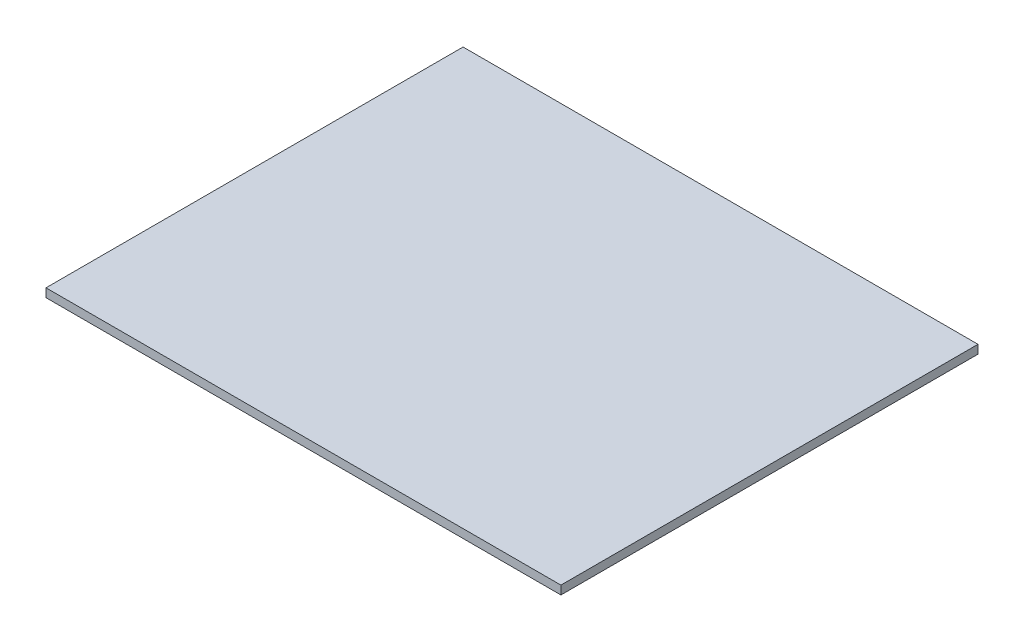
ISO-10303-21;
HEADER;
FILE_DESCRIPTION(('STEP AP214'),'2;1');
FILE_NAME('part.step','',(''),(''),'','','');
FILE_SCHEMA(('AUTOMOTIVE_DESIGN { 1 0 10303 214 1 1 1 1 }'));
ENDSEC;
DATA;
#1=APPLICATION_CONTEXT('core data for automotive mechanical design processes');
#2=APPLICATION_PROTOCOL_DEFINITION('international standard','automotive_design',2000,#1);
#3=PRODUCT_CONTEXT('',#1,'mechanical');
#4=PRODUCT('Part','Part','',(#3));
#5=PRODUCT_RELATED_PRODUCT_CATEGORY('part','',(#4));
#6=PRODUCT_DEFINITION_FORMATION('','',#4);
#7=PRODUCT_DEFINITION_CONTEXT('part definition',#1,'design');
#8=PRODUCT_DEFINITION('design','',#6,#7);
#9=PRODUCT_DEFINITION_SHAPE('','',#8);
#10=(LENGTH_UNIT() NAMED_UNIT(*) SI_UNIT(.MILLI.,.METRE.));
#11=(NAMED_UNIT(*) PLANE_ANGLE_UNIT() SI_UNIT($,.RADIAN.));
#12=(NAMED_UNIT(*) SI_UNIT($,.STERADIAN.) SOLID_ANGLE_UNIT());
#13=UNCERTAINTY_MEASURE_WITH_UNIT(LENGTH_MEASURE(1.E-05),#10,'distance_accuracy_value','');
#14=(GEOMETRIC_REPRESENTATION_CONTEXT(3) GLOBAL_UNCERTAINTY_ASSIGNED_CONTEXT((#13)) GLOBAL_UNIT_ASSIGNED_CONTEXT((#10,
#11,#12)) REPRESENTATION_CONTEXT('',''));
#15=CARTESIAN_POINT('',(0.,0.,0.));
#16=DIRECTION('',(0.,0.,1.));
#17=DIRECTION('',(1.,0.,0.));
#18=AXIS2_PLACEMENT_3D('',#15,#16,#17);
#19=CARTESIAN_POINT('',(0.,10.,0.));
#20=DIRECTION('',(1.,0.,0.));
#21=DIRECTION('',(0.,0.,-1.));
#22=AXIS2_PLACEMENT_3D('',#19,#20,#21);
#23=PLANE('',#22);
#24=DIRECTION('',(0.,0.,1.));
#25=VECTOR('',#24,1.);
#26=CARTESIAN_POINT('',(0.,0.,0.));
#27=LINE('',#26,#25);
#28=CARTESIAN_POINT('',(0.,0.,-486.));
#29=VERTEX_POINT('',#28);
#30=CARTESIAN_POINT('',(0.,0.,0.));
#31=VERTEX_POINT('',#30);
#32=EDGE_CURVE('E107',#29,#31,#27,.T.);
#33=ORIENTED_EDGE('',*,*,#32,.T.);
#34=DIRECTION('',(0.,-1.,0.));
#35=VECTOR('',#34,1.);
#36=CARTESIAN_POINT('',(0.,10.,0.));
#37=LINE('',#36,#35);
#38=CARTESIAN_POINT('',(0.,10.,0.));
#39=VERTEX_POINT('',#38);
#40=EDGE_CURVE('E11',#39,#31,#37,.T.);
#41=ORIENTED_EDGE('',*,*,#40,.F.);
#42=DIRECTION('',(0.,0.,1.));
#43=VECTOR('',#42,1.);
#44=CARTESIAN_POINT('',(0.,10.,0.));
#45=LINE('',#44,#43);
#46=CARTESIAN_POINT('',(0.,10.,-486.));
#47=VERTEX_POINT('',#46);
#48=EDGE_CURVE('E91',#47,#39,#45,.T.);
#49=ORIENTED_EDGE('',*,*,#48,.F.);
#50=DIRECTION('',(0.,-1.,0.));
#51=VECTOR('',#50,1.);
#52=CARTESIAN_POINT('',(0.,10.,-486.));
#53=LINE('',#52,#51);
#54=EDGE_CURVE('E103',#47,#29,#53,.T.);
#55=ORIENTED_EDGE('',*,*,#54,.T.);
#56=EDGE_LOOP('',(#33,#41,#49,#55));
#57=FACE_BOUND('',#56,.T.);
#58=ADVANCED_FACE('F39',(#57),#23,.F.);
#59=CARTESIAN_POINT('',(0.,10.,0.));
#60=DIRECTION('',(0.,0.,-1.));
#61=DIRECTION('',(-1.,0.,0.));
#62=AXIS2_PLACEMENT_3D('',#59,#60,#61);
#63=PLANE('',#62);
#64=DIRECTION('',(1.,0.,0.));
#65=VECTOR('',#64,1.);
#66=CARTESIAN_POINT('',(0.,0.,0.));
#67=LINE('',#66,#65);
#68=CARTESIAN_POINT('',(600.,0.,0.));
#69=VERTEX_POINT('',#68);
#70=EDGE_CURVE('E96',#31,#69,#67,.T.);
#71=ORIENTED_EDGE('',*,*,#70,.T.);
#72=DIRECTION('',(0.,-1.,0.));
#73=VECTOR('',#72,1.);
#74=CARTESIAN_POINT('',(600.,10.,0.));
#75=LINE('',#74,#73);
#76=CARTESIAN_POINT('',(600.,10.,0.));
#77=VERTEX_POINT('',#76);
#78=EDGE_CURVE('E48',#77,#69,#75,.T.);
#79=ORIENTED_EDGE('',*,*,#78,.F.);
#80=DIRECTION('',(1.,0.,0.));
#81=VECTOR('',#80,1.);
#82=CARTESIAN_POINT('',(0.,10.,0.));
#83=LINE('',#82,#81);
#84=EDGE_CURVE('E86',#39,#77,#83,.T.);
#85=ORIENTED_EDGE('',*,*,#84,.F.);
#86=ORIENTED_EDGE('',*,*,#40,.T.);
#87=EDGE_LOOP('',(#71,#79,#85,#86));
#88=FACE_BOUND('',#87,.T.);
#89=ADVANCED_FACE('F95',(#88),#63,.F.);
#90=CARTESIAN_POINT('',(600.,10.,0.));
#91=DIRECTION('',(-1.,0.,0.));
#92=DIRECTION('',(0.,0.,1.));
#93=AXIS2_PLACEMENT_3D('',#90,#91,#92);
#94=PLANE('',#93);
#95=DIRECTION('',(0.,0.,-1.));
#96=VECTOR('',#95,1.);
#97=CARTESIAN_POINT('',(600.,0.,0.));
#98=LINE('',#97,#96);
#99=CARTESIAN_POINT('',(600.,0.,-486.));
#100=VERTEX_POINT('',#99);
#101=EDGE_CURVE('E73',#69,#100,#98,.T.);
#102=ORIENTED_EDGE('',*,*,#101,.T.);
#103=DIRECTION('',(0.,-1.,0.));
#104=VECTOR('',#103,1.);
#105=CARTESIAN_POINT('',(600.,10.,-486.));
#106=LINE('',#105,#104);
#107=CARTESIAN_POINT('',(600.,10.,-486.));
#108=VERTEX_POINT('',#107);
#109=EDGE_CURVE('E98',#108,#100,#106,.T.);
#110=ORIENTED_EDGE('',*,*,#109,.F.);
#111=DIRECTION('',(0.,0.,-1.));
#112=VECTOR('',#111,1.);
#113=CARTESIAN_POINT('',(600.,10.,0.));
#114=LINE('',#113,#112);
#115=EDGE_CURVE('E89',#77,#108,#114,.T.);
#116=ORIENTED_EDGE('',*,*,#115,.F.);
#117=ORIENTED_EDGE('',*,*,#78,.T.);
#118=EDGE_LOOP('',(#102,#110,#116,#117));
#119=FACE_BOUND('',#118,.T.);
#120=ADVANCED_FACE('F99',(#119),#94,.F.);
#121=CARTESIAN_POINT('',(0.,10.,-486.));
#122=DIRECTION('',(0.,0.,1.));
#123=DIRECTION('',(1.,0.,0.));
#124=AXIS2_PLACEMENT_3D('',#121,#122,#123);
#125=PLANE('',#124);
#126=DIRECTION('',(-1.,0.,0.));
#127=VECTOR('',#126,1.);
#128=CARTESIAN_POINT('',(0.,0.,-486.));
#129=LINE('',#128,#127);
#130=EDGE_CURVE('E79',#100,#29,#129,.T.);
#131=ORIENTED_EDGE('',*,*,#130,.T.);
#132=ORIENTED_EDGE('',*,*,#54,.F.);
#133=DIRECTION('',(-1.,0.,0.));
#134=VECTOR('',#133,1.);
#135=CARTESIAN_POINT('',(0.,10.,-486.));
#136=LINE('',#135,#134);
#137=EDGE_CURVE('E56',#108,#47,#136,.T.);
#138=ORIENTED_EDGE('',*,*,#137,.F.);
#139=ORIENTED_EDGE('',*,*,#109,.T.);
#140=EDGE_LOOP('',(#131,#132,#138,#139));
#141=FACE_BOUND('',#140,.T.);
#142=ADVANCED_FACE('F120',(#141),#125,.F.);
#143=CARTESIAN_POINT('',(0.,10.,0.));
#144=DIRECTION('',(0.,-1.,0.));
#145=DIRECTION('',(0.,0.,-1.));
#146=AXIS2_PLACEMENT_3D('',#143,#144,#145);
#147=PLANE('',#146);
#148=ORIENTED_EDGE('',*,*,#48,.T.);
#149=ORIENTED_EDGE('',*,*,#84,.T.);
#150=ORIENTED_EDGE('',*,*,#115,.T.);
#151=ORIENTED_EDGE('',*,*,#137,.T.);
#152=EDGE_LOOP('',(#148,#149,#150,#151));
#153=FACE_BOUND('',#152,.T.);
#154=ADVANCED_FACE('F87',(#153),#147,.F.);
#155=CARTESIAN_POINT('',(0.,0.,0.));
#156=DIRECTION('',(0.,-1.,0.));
#157=DIRECTION('',(0.,0.,-1.));
#158=AXIS2_PLACEMENT_3D('',#155,#156,#157);
#159=PLANE('',#158);
#160=ORIENTED_EDGE('',*,*,#32,.F.);
#161=ORIENTED_EDGE('',*,*,#130,.F.);
#162=ORIENTED_EDGE('',*,*,#101,.F.);
#163=ORIENTED_EDGE('',*,*,#70,.F.);
#164=EDGE_LOOP('',(#160,#161,#162,#163));
#165=FACE_BOUND('',#164,.T.);
#166=ADVANCED_FACE('F123',(#165),#159,.T.);
#167=CLOSED_SHELL('',(#58,#89,#120,#142,#154,#166));
#168=MANIFOLD_SOLID_BREP('B2',#167);
#169=ADVANCED_BREP_SHAPE_REPRESENTATION('',(#18,#168),#14);
#170=SHAPE_DEFINITION_REPRESENTATION(#9,#169);
ENDSEC;
END-ISO-10303-21;
